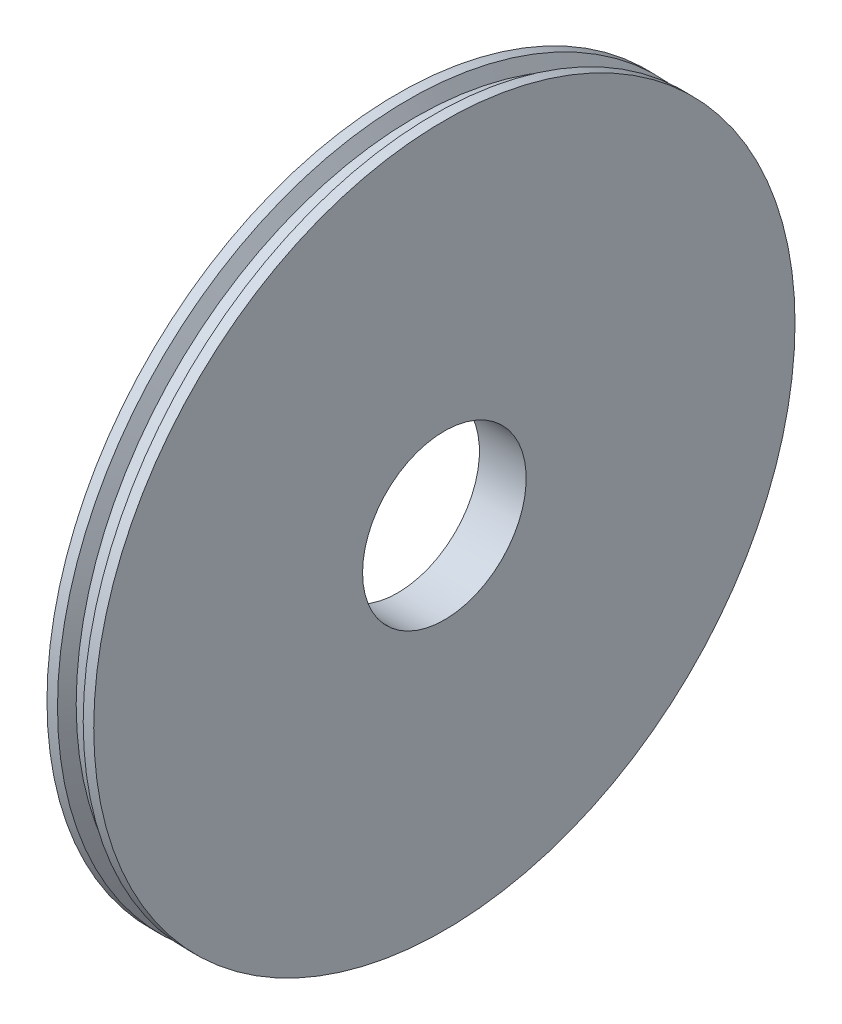
ISO-10303-21;
HEADER;
FILE_DESCRIPTION(('STEP AP214'),'2;1');
FILE_NAME('part.step','',(''),(''),'','','');
FILE_SCHEMA(('AUTOMOTIVE_DESIGN { 1 0 10303 214 1 1 1 1 }'));
ENDSEC;
DATA;
#1=APPLICATION_CONTEXT('core data for automotive mechanical design processes');
#2=APPLICATION_PROTOCOL_DEFINITION('international standard','automotive_design',2000,#1);
#3=PRODUCT_CONTEXT('',#1,'mechanical');
#4=PRODUCT('Part','Part','',(#3));
#5=PRODUCT_RELATED_PRODUCT_CATEGORY('part','',(#4));
#6=PRODUCT_DEFINITION_FORMATION('','',#4);
#7=PRODUCT_DEFINITION_CONTEXT('part definition',#1,'design');
#8=PRODUCT_DEFINITION('design','',#6,#7);
#9=PRODUCT_DEFINITION_SHAPE('','',#8);
#10=(LENGTH_UNIT() NAMED_UNIT(*) SI_UNIT(.MILLI.,.METRE.));
#11=(NAMED_UNIT(*) PLANE_ANGLE_UNIT() SI_UNIT($,.RADIAN.));
#12=(NAMED_UNIT(*) SI_UNIT($,.STERADIAN.) SOLID_ANGLE_UNIT());
#13=UNCERTAINTY_MEASURE_WITH_UNIT(LENGTH_MEASURE(1.E-05),#10,'distance_accuracy_value','');
#14=(GEOMETRIC_REPRESENTATION_CONTEXT(3) GLOBAL_UNCERTAINTY_ASSIGNED_CONTEXT((#13)) GLOBAL_UNIT_ASSIGNED_CONTEXT((#10,
#11,#12)) REPRESENTATION_CONTEXT('',''));
#15=CARTESIAN_POINT('',(0.,0.,0.));
#16=DIRECTION('',(0.,0.,1.));
#17=DIRECTION('',(1.,0.,0.));
#18=AXIS2_PLACEMENT_3D('',#15,#16,#17);
#19=CARTESIAN_POINT('',(-72.5196500286603,0.,0.));
#20=DIRECTION('',(-1.,0.,0.));
#21=DIRECTION('',(0.,0.,1.));
#22=AXIS2_PLACEMENT_3D('',#19,#20,#21);
#23=CYLINDRICAL_SURFACE('',#22,35.);
#24=CARTESIAN_POINT('',(9.99999999999999,0.,0.));
#25=DIRECTION('',(-1.,0.,0.));
#26=DIRECTION('',(0.,0.,1.));
#27=AXIS2_PLACEMENT_3D('',#24,#25,#26);
#28=CIRCLE('',#27,35.);
#29=CARTESIAN_POINT('',(9.99999999999999,0.,35.));
#30=VERTEX_POINT('',#29);
#31=EDGE_CURVE('E63',#30,#30,#28,.T.);
#32=ORIENTED_EDGE('',*,*,#31,.F.);
#33=EDGE_LOOP('',(#32));
#34=FACE_BOUND('',#33,.T.);
#35=CARTESIAN_POINT('',(-10.,0.,0.));
#36=DIRECTION('',(-1.,0.,0.));
#37=DIRECTION('',(0.,0.,1.));
#38=AXIS2_PLACEMENT_3D('',#35,#36,#37);
#39=CIRCLE('',#38,35.);
#40=CARTESIAN_POINT('',(-10.,0.,35.));
#41=VERTEX_POINT('',#40);
#42=EDGE_CURVE('E10',#41,#41,#39,.T.);
#43=ORIENTED_EDGE('',*,*,#42,.T.);
#44=EDGE_LOOP('',(#43));
#45=FACE_BOUND('',#44,.T.);
#46=ADVANCED_FACE('F35',(#34,#45),#23,.F.);
#47=CARTESIAN_POINT('',(-10.,35.,0.));
#48=DIRECTION('',(1.,0.,0.));
#49=DIRECTION('',(0.,0.,-1.));
#50=AXIS2_PLACEMENT_3D('',#47,#48,#49);
#51=PLANE('',#50);
#52=ORIENTED_EDGE('',*,*,#42,.F.);
#53=EDGE_LOOP('',(#52));
#54=FACE_BOUND('',#53,.T.);
#55=CARTESIAN_POINT('',(-10.,0.,0.));
#56=DIRECTION('',(-1.,0.,0.));
#57=DIRECTION('',(0.,0.,1.));
#58=AXIS2_PLACEMENT_3D('',#55,#56,#57);
#59=CIRCLE('',#58,150.);
#60=CARTESIAN_POINT('',(-10.,0.,150.));
#61=VERTEX_POINT('',#60);
#62=EDGE_CURVE('E41',#61,#61,#59,.T.);
#63=ORIENTED_EDGE('',*,*,#62,.T.);
#64=EDGE_LOOP('',(#63));
#65=FACE_BOUND('',#64,.T.);
#66=ADVANCED_FACE('F70',(#54,#65),#51,.F.);
#67=CARTESIAN_POINT('',(-72.5196500286603,0.,0.));
#68=DIRECTION('',(-1.,0.,0.));
#69=DIRECTION('',(0.,0.,1.));
#70=AXIS2_PLACEMENT_3D('',#67,#68,#69);
#71=CYLINDRICAL_SURFACE('',#70,150.);
#72=ORIENTED_EDGE('',*,*,#62,.F.);
#73=EDGE_LOOP('',(#72));
#74=FACE_BOUND('',#73,.T.);
#75=CARTESIAN_POINT('',(-5.50000000000001,0.,0.));
#76=DIRECTION('',(-1.,0.,0.));
#77=DIRECTION('',(0.,0.,1.));
#78=AXIS2_PLACEMENT_3D('',#75,#76,#77);
#79=CIRCLE('',#78,150.);
#80=CARTESIAN_POINT('',(-5.50000000000001,0.,150.));
#81=VERTEX_POINT('',#80);
#82=EDGE_CURVE('E45',#81,#81,#79,.T.);
#83=ORIENTED_EDGE('',*,*,#82,.T.);
#84=EDGE_LOOP('',(#83));
#85=FACE_BOUND('',#84,.T.);
#86=ADVANCED_FACE('F74',(#74,#85),#71,.T.);
#87=CARTESIAN_POINT('',(-2.5,0.,0.));
#88=DIRECTION('',(-1.,0.,0.));
#89=DIRECTION('',(0.,0.,1.));
#90=AXIS2_PLACEMENT_3D('',#87,#88,#89);
#91=CONICAL_SURFACE('',#90,145.,1.03037682652431);
#92=ORIENTED_EDGE('',*,*,#82,.F.);
#93=EDGE_LOOP('',(#92));
#94=FACE_BOUND('',#93,.T.);
#95=CARTESIAN_POINT('',(-2.5,0.,0.));
#96=DIRECTION('',(-1.,0.,0.));
#97=DIRECTION('',(0.,0.,1.));
#98=AXIS2_PLACEMENT_3D('',#95,#96,#97);
#99=CIRCLE('',#98,145.);
#100=CARTESIAN_POINT('',(-2.5,0.,145.));
#101=VERTEX_POINT('',#100);
#102=EDGE_CURVE('E49',#101,#101,#99,.T.);
#103=ORIENTED_EDGE('',*,*,#102,.T.);
#104=EDGE_LOOP('',(#103));
#105=FACE_BOUND('',#104,.T.);
#106=ADVANCED_FACE('F79',(#94,#105),#91,.T.);
#107=CARTESIAN_POINT('',(-72.5196500286603,0.,0.));
#108=DIRECTION('',(-1.,0.,0.));
#109=DIRECTION('',(0.,0.,1.));
#110=AXIS2_PLACEMENT_3D('',#107,#108,#109);
#111=CYLINDRICAL_SURFACE('',#110,145.);
#112=ORIENTED_EDGE('',*,*,#102,.F.);
#113=EDGE_LOOP('',(#112));
#114=FACE_BOUND('',#113,.T.);
#115=CARTESIAN_POINT('',(2.49999999999999,0.,0.));
#116=DIRECTION('',(-1.,0.,0.));
#117=DIRECTION('',(0.,0.,1.));
#118=AXIS2_PLACEMENT_3D('',#115,#116,#117);
#119=CIRCLE('',#118,145.);
#120=CARTESIAN_POINT('',(2.49999999999999,0.,145.));
#121=VERTEX_POINT('',#120);
#122=EDGE_CURVE('E54',#121,#121,#119,.T.);
#123=ORIENTED_EDGE('',*,*,#122,.T.);
#124=EDGE_LOOP('',(#123));
#125=FACE_BOUND('',#124,.T.);
#126=ADVANCED_FACE('F85',(#114,#125),#111,.T.);
#127=CARTESIAN_POINT('',(5.49999999999999,0.,0.));
#128=DIRECTION('',(1.,0.,0.));
#129=DIRECTION('',(0.,0.,-1.));
#130=AXIS2_PLACEMENT_3D('',#127,#128,#129);
#131=CONICAL_SURFACE('',#130,150.,1.03037682652431);
#132=ORIENTED_EDGE('',*,*,#122,.F.);
#133=EDGE_LOOP('',(#132));
#134=FACE_BOUND('',#133,.T.);
#135=CARTESIAN_POINT('',(5.49999999999999,0.,0.));
#136=DIRECTION('',(-1.,0.,0.));
#137=DIRECTION('',(0.,0.,1.));
#138=AXIS2_PLACEMENT_3D('',#135,#136,#137);
#139=CIRCLE('',#138,150.);
#140=CARTESIAN_POINT('',(5.49999999999999,0.,150.));
#141=VERTEX_POINT('',#140);
#142=EDGE_CURVE('E57',#141,#141,#139,.T.);
#143=ORIENTED_EDGE('',*,*,#142,.T.);
#144=EDGE_LOOP('',(#143));
#145=FACE_BOUND('',#144,.T.);
#146=ADVANCED_FACE('F89',(#134,#145),#131,.T.);
#147=CARTESIAN_POINT('',(-72.5196500286603,0.,0.));
#148=DIRECTION('',(-1.,0.,0.));
#149=DIRECTION('',(0.,0.,1.));
#150=AXIS2_PLACEMENT_3D('',#147,#148,#149);
#151=CYLINDRICAL_SURFACE('',#150,150.);
#152=ORIENTED_EDGE('',*,*,#142,.F.);
#153=EDGE_LOOP('',(#152));
#154=FACE_BOUND('',#153,.T.);
#155=CARTESIAN_POINT('',(9.99999999999999,0.,0.));
#156=DIRECTION('',(-1.,0.,0.));
#157=DIRECTION('',(0.,0.,1.));
#158=AXIS2_PLACEMENT_3D('',#155,#156,#157);
#159=CIRCLE('',#158,150.);
#160=CARTESIAN_POINT('',(9.99999999999999,0.,150.));
#161=VERTEX_POINT('',#160);
#162=EDGE_CURVE('E60',#161,#161,#159,.T.);
#163=ORIENTED_EDGE('',*,*,#162,.T.);
#164=EDGE_LOOP('',(#163));
#165=FACE_BOUND('',#164,.T.);
#166=ADVANCED_FACE('F93',(#154,#165),#151,.T.);
#167=CARTESIAN_POINT('',(9.99999999999999,35.,0.));
#168=DIRECTION('',(-1.,0.,0.));
#169=DIRECTION('',(0.,0.,1.));
#170=AXIS2_PLACEMENT_3D('',#167,#168,#169);
#171=PLANE('',#170);
#172=ORIENTED_EDGE('',*,*,#162,.F.);
#173=EDGE_LOOP('',(#172));
#174=FACE_BOUND('',#173,.T.);
#175=ORIENTED_EDGE('',*,*,#31,.T.);
#176=EDGE_LOOP('',(#175));
#177=FACE_BOUND('',#176,.T.);
#178=ADVANCED_FACE('F67',(#174,#177),#171,.F.);
#179=CLOSED_SHELL('',(#46,#66,#86,#106,#126,#146,#166,#178));
#180=MANIFOLD_SOLID_BREP('B2',#179);
#181=ADVANCED_BREP_SHAPE_REPRESENTATION('',(#18,#180),#14);
#182=SHAPE_DEFINITION_REPRESENTATION(#9,#181);
ENDSEC;
END-ISO-10303-21;
